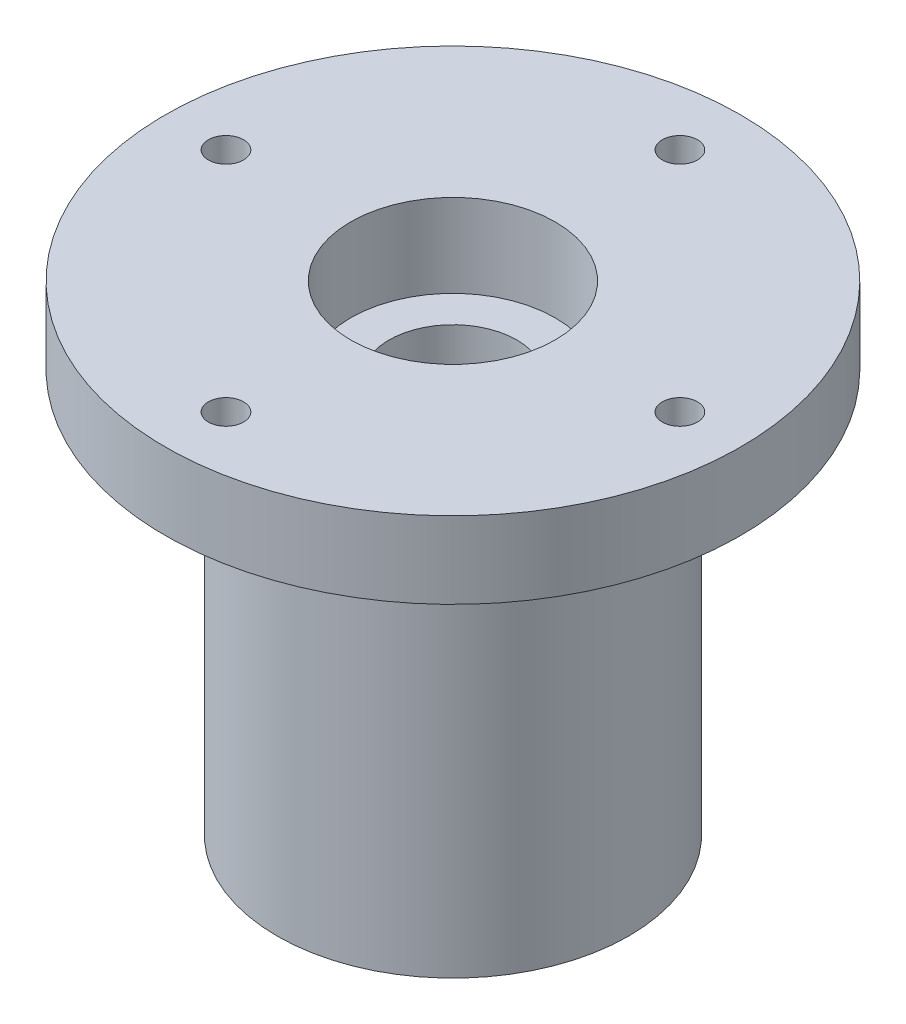
ISO-10303-21;
HEADER;
FILE_DESCRIPTION(('STEP AP214'),'2;1');
FILE_NAME('part.step','',(''),(''),'','','');
FILE_SCHEMA(('AUTOMOTIVE_DESIGN { 1 0 10303 214 1 1 1 1 }'));
ENDSEC;
DATA;
#1=APPLICATION_CONTEXT('core data for automotive mechanical design processes');
#2=APPLICATION_PROTOCOL_DEFINITION('international standard','automotive_design',2000,#1);
#3=PRODUCT_CONTEXT('',#1,'mechanical');
#4=PRODUCT('Part','Part','',(#3));
#5=PRODUCT_RELATED_PRODUCT_CATEGORY('part','',(#4));
#6=PRODUCT_DEFINITION_FORMATION('','',#4);
#7=PRODUCT_DEFINITION_CONTEXT('part definition',#1,'design');
#8=PRODUCT_DEFINITION('design','',#6,#7);
#9=PRODUCT_DEFINITION_SHAPE('','',#8);
#10=(LENGTH_UNIT() NAMED_UNIT(*) SI_UNIT(.MILLI.,.METRE.));
#11=(NAMED_UNIT(*) PLANE_ANGLE_UNIT() SI_UNIT($,.RADIAN.));
#12=(NAMED_UNIT(*) SI_UNIT($,.STERADIAN.) SOLID_ANGLE_UNIT());
#13=UNCERTAINTY_MEASURE_WITH_UNIT(LENGTH_MEASURE(1.E-05),#10,'distance_accuracy_value','');
#14=(GEOMETRIC_REPRESENTATION_CONTEXT(3) GLOBAL_UNCERTAINTY_ASSIGNED_CONTEXT((#13)) GLOBAL_UNIT_ASSIGNED_CONTEXT((#10,
#11,#12)) REPRESENTATION_CONTEXT('',''));
#15=CARTESIAN_POINT('',(0.,0.,0.));
#16=DIRECTION('',(0.,0.,1.));
#17=DIRECTION('',(1.,0.,0.));
#18=AXIS2_PLACEMENT_3D('',#15,#16,#17);
#19=CARTESIAN_POINT('',(-27.5,-12.,0.));
#20=DIRECTION('',(0.,1.,0.));
#21=DIRECTION('',(0.,0.,1.));
#22=AXIS2_PLACEMENT_3D('',#19,#20,#21);
#23=PLANE('',#22);
#24=CARTESIAN_POINT('',(0.,-12.,35.5));
#25=DIRECTION('',(0.,-1.,0.));
#26=DIRECTION('',(0.,0.,-1.));
#27=AXIS2_PLACEMENT_3D('',#24,#25,#26);
#28=CIRCLE('',#27,6.);
#29=CARTESIAN_POINT('',(0.,-12.,29.5));
#30=VERTEX_POINT('',#29);
#31=EDGE_CURVE('E102',#30,#30,#28,.T.);
#32=ORIENTED_EDGE('',*,*,#31,.F.);
#33=EDGE_LOOP('',(#32));
#34=FACE_BOUND('',#33,.T.);
#35=CARTESIAN_POINT('',(-35.5,-12.,0.));
#36=DIRECTION('',(0.,-1.,0.));
#37=DIRECTION('',(0.,0.,-1.));
#38=AXIS2_PLACEMENT_3D('',#35,#36,#37);
#39=CIRCLE('',#38,6.);
#40=CARTESIAN_POINT('',(-35.5,-12.,-6.));
#41=VERTEX_POINT('',#40);
#42=EDGE_CURVE('E93',#41,#41,#39,.T.);
#43=ORIENTED_EDGE('',*,*,#42,.F.);
#44=EDGE_LOOP('',(#43));
#45=FACE_BOUND('',#44,.T.);
#46=CARTESIAN_POINT('',(0.,-12.,-35.5));
#47=DIRECTION('',(0.,-1.,0.));
#48=DIRECTION('',(0.,0.,-1.));
#49=AXIS2_PLACEMENT_3D('',#46,#47,#48);
#50=CIRCLE('',#49,6.);
#51=CARTESIAN_POINT('',(0.,-12.,-41.5));
#52=VERTEX_POINT('',#51);
#53=EDGE_CURVE('E84',#52,#52,#50,.T.);
#54=ORIENTED_EDGE('',*,*,#53,.F.);
#55=EDGE_LOOP('',(#54));
#56=FACE_BOUND('',#55,.T.);
#57=CARTESIAN_POINT('',(0.,-12.,0.));
#58=DIRECTION('',(0.,-1.,0.));
#59=DIRECTION('',(0.,0.,-1.));
#60=AXIS2_PLACEMENT_3D('',#57,#58,#59);
#61=CIRCLE('',#60,27.5);
#62=CARTESIAN_POINT('',(0.,-12.,-27.5));
#63=VERTEX_POINT('',#62);
#64=EDGE_CURVE('E63',#63,#63,#61,.T.);
#65=ORIENTED_EDGE('',*,*,#64,.F.);
#66=EDGE_LOOP('',(#65));
#67=FACE_BOUND('',#66,.T.);
#68=CARTESIAN_POINT('',(0.,-12.,0.));
#69=DIRECTION('',(0.,-1.,0.));
#70=DIRECTION('',(0.,0.,-1.));
#71=AXIS2_PLACEMENT_3D('',#68,#69,#70);
#72=CIRCLE('',#71,45.);
#73=CARTESIAN_POINT('',(0.,-12.,-45.));
#74=VERTEX_POINT('',#73);
#75=EDGE_CURVE('E66',#74,#74,#72,.T.);
#76=ORIENTED_EDGE('',*,*,#75,.T.);
#77=EDGE_LOOP('',(#76));
#78=FACE_BOUND('',#77,.T.);
#79=CARTESIAN_POINT('',(35.5,-12.,0.));
#80=DIRECTION('',(0.,-1.,0.));
#81=DIRECTION('',(0.,0.,-1.));
#82=AXIS2_PLACEMENT_3D('',#79,#80,#81);
#83=CIRCLE('',#82,6.);
#84=CARTESIAN_POINT('',(35.5,-12.,-6.));
#85=VERTEX_POINT('',#84);
#86=EDGE_CURVE('E75',#85,#85,#83,.T.);
#87=ORIENTED_EDGE('',*,*,#86,.F.);
#88=EDGE_LOOP('',(#87));
#89=FACE_BOUND('',#88,.T.);
#90=ADVANCED_FACE('F31',(#34,#45,#56,#67,#78,#89),#23,.F.);
#91=CARTESIAN_POINT('',(0.,0.,0.));
#92=DIRECTION('',(0.,-1.,0.));
#93=DIRECTION('',(0.,0.,-1.));
#94=AXIS2_PLACEMENT_3D('',#91,#92,#93);
#95=CYLINDRICAL_SURFACE('',#94,45.);
#96=ORIENTED_EDGE('',*,*,#75,.F.);
#97=EDGE_LOOP('',(#96));
#98=FACE_BOUND('',#97,.T.);
#99=CARTESIAN_POINT('',(0.,0.,0.));
#100=DIRECTION('',(0.,-1.,0.));
#101=DIRECTION('',(0.,0.,-1.));
#102=AXIS2_PLACEMENT_3D('',#99,#100,#101);
#103=CIRCLE('',#102,45.);
#104=CARTESIAN_POINT('',(0.,0.,-45.));
#105=VERTEX_POINT('',#104);
#106=EDGE_CURVE('E10',#105,#105,#103,.T.);
#107=ORIENTED_EDGE('',*,*,#106,.T.);
#108=EDGE_LOOP('',(#107));
#109=FACE_BOUND('',#108,.T.);
#110=ADVANCED_FACE('F33',(#98,#109),#95,.T.);
#111=CARTESIAN_POINT('',(-45.,0.,0.));
#112=DIRECTION('',(0.,-1.,0.));
#113=DIRECTION('',(0.,0.,-1.));
#114=AXIS2_PLACEMENT_3D('',#111,#112,#113);
#115=PLANE('',#114);
#116=CARTESIAN_POINT('',(0.,0.,35.5));
#117=DIRECTION('',(0.,-1.,0.));
#118=DIRECTION('',(0.,0.,-1.));
#119=AXIS2_PLACEMENT_3D('',#116,#117,#118);
#120=CIRCLE('',#119,2.74999999999999);
#121=CARTESIAN_POINT('',(0.,0.,32.75));
#122=VERTEX_POINT('',#121);
#123=EDGE_CURVE('E96',#122,#122,#120,.T.);
#124=ORIENTED_EDGE('',*,*,#123,.T.);
#125=EDGE_LOOP('',(#124));
#126=FACE_BOUND('',#125,.T.);
#127=CARTESIAN_POINT('',(-35.5,0.,0.));
#128=DIRECTION('',(0.,-1.,0.));
#129=DIRECTION('',(0.,0.,-1.));
#130=AXIS2_PLACEMENT_3D('',#127,#128,#129);
#131=CIRCLE('',#130,2.74999999999999);
#132=CARTESIAN_POINT('',(-35.5,0.,-2.74999999999999));
#133=VERTEX_POINT('',#132);
#134=EDGE_CURVE('E87',#133,#133,#131,.T.);
#135=ORIENTED_EDGE('',*,*,#134,.T.);
#136=EDGE_LOOP('',(#135));
#137=FACE_BOUND('',#136,.T.);
#138=CARTESIAN_POINT('',(0.,0.,-35.5));
#139=DIRECTION('',(0.,-1.,0.));
#140=DIRECTION('',(0.,0.,-1.));
#141=AXIS2_PLACEMENT_3D('',#138,#139,#140);
#142=CIRCLE('',#141,2.74999999999999);
#143=CARTESIAN_POINT('',(0.,0.,-38.25));
#144=VERTEX_POINT('',#143);
#145=EDGE_CURVE('E78',#144,#144,#142,.T.);
#146=ORIENTED_EDGE('',*,*,#145,.T.);
#147=EDGE_LOOP('',(#146));
#148=FACE_BOUND('',#147,.T.);
#149=CARTESIAN_POINT('',(35.5,0.,0.));
#150=DIRECTION('',(0.,-1.,0.));
#151=DIRECTION('',(0.,0.,-1.));
#152=AXIS2_PLACEMENT_3D('',#149,#150,#151);
#153=CIRCLE('',#152,2.74999999999999);
#154=CARTESIAN_POINT('',(35.5,0.,-2.74999999999999));
#155=VERTEX_POINT('',#154);
#156=EDGE_CURVE('E69',#155,#155,#153,.T.);
#157=ORIENTED_EDGE('',*,*,#156,.T.);
#158=EDGE_LOOP('',(#157));
#159=FACE_BOUND('',#158,.T.);
#160=ORIENTED_EDGE('',*,*,#106,.F.);
#161=EDGE_LOOP('',(#160));
#162=FACE_BOUND('',#161,.T.);
#163=CARTESIAN_POINT('',(0.,0.,0.));
#164=DIRECTION('',(0.,-1.,0.));
#165=DIRECTION('',(0.,0.,-1.));
#166=AXIS2_PLACEMENT_3D('',#163,#164,#165);
#167=CIRCLE('',#166,16.);
#168=CARTESIAN_POINT('',(0.,0.,-16.));
#169=VERTEX_POINT('',#168);
#170=EDGE_CURVE('E38',#169,#169,#167,.T.);
#171=ORIENTED_EDGE('',*,*,#170,.T.);
#172=EDGE_LOOP('',(#171));
#173=FACE_BOUND('',#172,.T.);
#174=ADVANCED_FACE('F165',(#126,#137,#148,#159,#162,#173),#115,.F.);
#175=CARTESIAN_POINT('',(0.,0.,0.));
#176=DIRECTION('',(0.,-1.,0.));
#177=DIRECTION('',(0.,0.,-1.));
#178=AXIS2_PLACEMENT_3D('',#175,#176,#177);
#179=CYLINDRICAL_SURFACE('',#178,16.);
#180=ORIENTED_EDGE('',*,*,#170,.F.);
#181=EDGE_LOOP('',(#180));
#182=FACE_BOUND('',#181,.T.);
#183=CARTESIAN_POINT('',(0.,-13.,0.));
#184=DIRECTION('',(0.,-1.,0.));
#185=DIRECTION('',(0.,0.,-1.));
#186=AXIS2_PLACEMENT_3D('',#183,#184,#185);
#187=CIRCLE('',#186,16.);
#188=CARTESIAN_POINT('',(0.,-13.,-16.));
#189=VERTEX_POINT('',#188);
#190=EDGE_CURVE('E42',#189,#189,#187,.T.);
#191=ORIENTED_EDGE('',*,*,#190,.T.);
#192=EDGE_LOOP('',(#191));
#193=FACE_BOUND('',#192,.T.);
#194=ADVANCED_FACE('F162',(#182,#193),#179,.F.);
#195=CARTESIAN_POINT('',(-16.,-13.,0.));
#196=DIRECTION('',(0.,-1.,0.));
#197=DIRECTION('',(0.,0.,-1.));
#198=AXIS2_PLACEMENT_3D('',#195,#196,#197);
#199=PLANE('',#198);
#200=ORIENTED_EDGE('',*,*,#190,.F.);
#201=EDGE_LOOP('',(#200));
#202=FACE_BOUND('',#201,.T.);
#203=CARTESIAN_POINT('',(0.,-13.,0.));
#204=DIRECTION('',(0.,-1.,0.));
#205=DIRECTION('',(0.,0.,-1.));
#206=AXIS2_PLACEMENT_3D('',#203,#204,#205);
#207=CIRCLE('',#206,10.);
#208=CARTESIAN_POINT('',(0.,-13.,-10.));
#209=VERTEX_POINT('',#208);
#210=EDGE_CURVE('E46',#209,#209,#207,.T.);
#211=ORIENTED_EDGE('',*,*,#210,.T.);
#212=EDGE_LOOP('',(#211));
#213=FACE_BOUND('',#212,.T.);
#214=ADVANCED_FACE('F158',(#202,#213),#199,.F.);
#215=CARTESIAN_POINT('',(0.,0.,0.));
#216=DIRECTION('',(0.,-1.,0.));
#217=DIRECTION('',(0.,0.,-1.));
#218=AXIS2_PLACEMENT_3D('',#215,#216,#217);
#219=CYLINDRICAL_SURFACE('',#218,10.);
#220=ORIENTED_EDGE('',*,*,#210,.F.);
#221=EDGE_LOOP('',(#220));
#222=FACE_BOUND('',#221,.T.);
#223=CARTESIAN_POINT('',(0.,-62.,0.));
#224=DIRECTION('',(0.,-1.,0.));
#225=DIRECTION('',(0.,0.,-1.));
#226=AXIS2_PLACEMENT_3D('',#223,#224,#225);
#227=CIRCLE('',#226,9.99999999999999);
#228=CARTESIAN_POINT('',(0.,-62.,-9.99999999999999));
#229=VERTEX_POINT('',#228);
#230=EDGE_CURVE('E51',#229,#229,#227,.T.);
#231=ORIENTED_EDGE('',*,*,#230,.T.);
#232=EDGE_LOOP('',(#231));
#233=FACE_BOUND('',#232,.T.);
#234=ADVANCED_FACE('F154',(#222,#233),#219,.F.);
#235=CARTESIAN_POINT('',(-9.99999999999999,-62.,0.));
#236=DIRECTION('',(0.,1.,0.));
#237=DIRECTION('',(0.,0.,1.));
#238=AXIS2_PLACEMENT_3D('',#235,#236,#237);
#239=PLANE('',#238);
#240=ORIENTED_EDGE('',*,*,#230,.F.);
#241=EDGE_LOOP('',(#240));
#242=FACE_BOUND('',#241,.T.);
#243=CARTESIAN_POINT('',(0.,-62.,0.));
#244=DIRECTION('',(0.,-1.,0.));
#245=DIRECTION('',(0.,0.,-1.));
#246=AXIS2_PLACEMENT_3D('',#243,#244,#245);
#247=CIRCLE('',#246,16.);
#248=CARTESIAN_POINT('',(0.,-62.,-16.));
#249=VERTEX_POINT('',#248);
#250=EDGE_CURVE('E54',#249,#249,#247,.T.);
#251=ORIENTED_EDGE('',*,*,#250,.T.);
#252=EDGE_LOOP('',(#251));
#253=FACE_BOUND('',#252,.T.);
#254=ADVANCED_FACE('F150',(#242,#253),#239,.F.);
#255=CARTESIAN_POINT('',(0.,0.,0.));
#256=DIRECTION('',(0.,-1.,0.));
#257=DIRECTION('',(0.,0.,-1.));
#258=AXIS2_PLACEMENT_3D('',#255,#256,#257);
#259=CYLINDRICAL_SURFACE('',#258,16.);
#260=ORIENTED_EDGE('',*,*,#250,.F.);
#261=EDGE_LOOP('',(#260));
#262=FACE_BOUND('',#261,.T.);
#263=CARTESIAN_POINT('',(0.,-75.,0.));
#264=DIRECTION('',(0.,-1.,0.));
#265=DIRECTION('',(0.,0.,-1.));
#266=AXIS2_PLACEMENT_3D('',#263,#264,#265);
#267=CIRCLE('',#266,16.);
#268=CARTESIAN_POINT('',(0.,-75.,-16.));
#269=VERTEX_POINT('',#268);
#270=EDGE_CURVE('E57',#269,#269,#267,.T.);
#271=ORIENTED_EDGE('',*,*,#270,.T.);
#272=EDGE_LOOP('',(#271));
#273=FACE_BOUND('',#272,.T.);
#274=ADVANCED_FACE('F146',(#262,#273),#259,.F.);
#275=CARTESIAN_POINT('',(-16.,-75.,0.));
#276=DIRECTION('',(0.,1.,0.));
#277=DIRECTION('',(0.,0.,1.));
#278=AXIS2_PLACEMENT_3D('',#275,#276,#277);
#279=PLANE('',#278);
#280=ORIENTED_EDGE('',*,*,#270,.F.);
#281=EDGE_LOOP('',(#280));
#282=FACE_BOUND('',#281,.T.);
#283=CARTESIAN_POINT('',(0.,-75.,0.));
#284=DIRECTION('',(0.,-1.,0.));
#285=DIRECTION('',(0.,0.,-1.));
#286=AXIS2_PLACEMENT_3D('',#283,#284,#285);
#287=CIRCLE('',#286,27.5);
#288=CARTESIAN_POINT('',(0.,-75.,-27.5));
#289=VERTEX_POINT('',#288);
#290=EDGE_CURVE('E60',#289,#289,#287,.T.);
#291=ORIENTED_EDGE('',*,*,#290,.T.);
#292=EDGE_LOOP('',(#291));
#293=FACE_BOUND('',#292,.T.);
#294=ADVANCED_FACE('F142',(#282,#293),#279,.F.);
#295=CARTESIAN_POINT('',(0.,0.,0.));
#296=DIRECTION('',(0.,-1.,0.));
#297=DIRECTION('',(0.,0.,-1.));
#298=AXIS2_PLACEMENT_3D('',#295,#296,#297);
#299=CYLINDRICAL_SURFACE('',#298,27.5);
#300=ORIENTED_EDGE('',*,*,#290,.F.);
#301=EDGE_LOOP('',(#300));
#302=FACE_BOUND('',#301,.T.);
#303=ORIENTED_EDGE('',*,*,#64,.T.);
#304=EDGE_LOOP('',(#303));
#305=FACE_BOUND('',#304,.T.);
#306=ADVANCED_FACE('F134',(#302,#305),#299,.T.);
#307=CARTESIAN_POINT('',(35.5,-12.,0.));
#308=DIRECTION('',(0.,-1.,0.));
#309=DIRECTION('',(0.,0.,-1.));
#310=AXIS2_PLACEMENT_3D('',#307,#308,#309);
#311=CYLINDRICAL_SURFACE('',#310,2.74999999999999);
#312=ORIENTED_EDGE('',*,*,#156,.F.);
#313=EDGE_LOOP('',(#312));
#314=FACE_BOUND('',#313,.T.);
#315=CARTESIAN_POINT('',(35.5,-8.75,0.));
#316=DIRECTION('',(0.,-1.,0.));
#317=DIRECTION('',(0.,0.,-1.));
#318=AXIS2_PLACEMENT_3D('',#315,#316,#317);
#319=CIRCLE('',#318,2.74999999999999);
#320=CARTESIAN_POINT('',(35.5,-8.75,-2.74999999999999));
#321=VERTEX_POINT('',#320);
#322=EDGE_CURVE('E72',#321,#321,#319,.T.);
#323=ORIENTED_EDGE('',*,*,#322,.T.);
#324=EDGE_LOOP('',(#323));
#325=FACE_BOUND('',#324,.T.);
#326=ADVANCED_FACE('F124',(#314,#325),#311,.F.);
#327=CARTESIAN_POINT('',(35.5,-12.,0.));
#328=DIRECTION('',(0.,-1.,0.));
#329=DIRECTION('',(0.,0.,-1.));
#330=AXIS2_PLACEMENT_3D('',#327,#328,#329);
#331=CONICAL_SURFACE('',#330,6.,0.785398163397449);
#332=ORIENTED_EDGE('',*,*,#322,.F.);
#333=EDGE_LOOP('',(#332));
#334=FACE_BOUND('',#333,.T.);
#335=ORIENTED_EDGE('',*,*,#86,.T.);
#336=EDGE_LOOP('',(#335));
#337=FACE_BOUND('',#336,.T.);
#338=ADVANCED_FACE('F121',(#334,#337),#331,.F.);
#339=CARTESIAN_POINT('',(0.,-12.,-35.5));
#340=DIRECTION('',(0.,-1.,0.));
#341=DIRECTION('',(0.,0.,-1.));
#342=AXIS2_PLACEMENT_3D('',#339,#340,#341);
#343=CYLINDRICAL_SURFACE('',#342,2.74999999999999);
#344=ORIENTED_EDGE('',*,*,#145,.F.);
#345=EDGE_LOOP('',(#344));
#346=FACE_BOUND('',#345,.T.);
#347=CARTESIAN_POINT('',(0.,-8.75,-35.5));
#348=DIRECTION('',(0.,-1.,0.));
#349=DIRECTION('',(0.,0.,-1.));
#350=AXIS2_PLACEMENT_3D('',#347,#348,#349);
#351=CIRCLE('',#350,2.74999999999999);
#352=CARTESIAN_POINT('',(0.,-8.75,-38.25));
#353=VERTEX_POINT('',#352);
#354=EDGE_CURVE('E81',#353,#353,#351,.T.);
#355=ORIENTED_EDGE('',*,*,#354,.T.);
#356=EDGE_LOOP('',(#355));
#357=FACE_BOUND('',#356,.T.);
#358=ADVANCED_FACE('F123',(#346,#357),#343,.F.);
#359=CARTESIAN_POINT('',(0.,-12.,-35.5));
#360=DIRECTION('',(0.,-1.,0.));
#361=DIRECTION('',(0.,0.,-1.));
#362=AXIS2_PLACEMENT_3D('',#359,#360,#361);
#363=CONICAL_SURFACE('',#362,6.,0.785398163397449);
#364=ORIENTED_EDGE('',*,*,#354,.F.);
#365=EDGE_LOOP('',(#364));
#366=FACE_BOUND('',#365,.T.);
#367=ORIENTED_EDGE('',*,*,#53,.T.);
#368=EDGE_LOOP('',(#367));
#369=FACE_BOUND('',#368,.T.);
#370=ADVANCED_FACE('F131',(#366,#369),#363,.F.);
#371=CARTESIAN_POINT('',(-35.5,-12.,0.));
#372=DIRECTION('',(0.,-1.,0.));
#373=DIRECTION('',(0.,0.,-1.));
#374=AXIS2_PLACEMENT_3D('',#371,#372,#373);
#375=CYLINDRICAL_SURFACE('',#374,2.74999999999999);
#376=ORIENTED_EDGE('',*,*,#134,.F.);
#377=EDGE_LOOP('',(#376));
#378=FACE_BOUND('',#377,.T.);
#379=CARTESIAN_POINT('',(-35.5,-8.75,0.));
#380=DIRECTION('',(0.,-1.,0.));
#381=DIRECTION('',(0.,0.,-1.));
#382=AXIS2_PLACEMENT_3D('',#379,#380,#381);
#383=CIRCLE('',#382,2.74999999999999);
#384=CARTESIAN_POINT('',(-35.5,-8.75,-2.74999999999999));
#385=VERTEX_POINT('',#384);
#386=EDGE_CURVE('E90',#385,#385,#383,.T.);
#387=ORIENTED_EDGE('',*,*,#386,.T.);
#388=EDGE_LOOP('',(#387));
#389=FACE_BOUND('',#388,.T.);
#390=ADVANCED_FACE('F187',(#378,#389),#375,.F.);
#391=CARTESIAN_POINT('',(-35.5,-12.,0.));
#392=DIRECTION('',(0.,-1.,0.));
#393=DIRECTION('',(0.,0.,-1.));
#394=AXIS2_PLACEMENT_3D('',#391,#392,#393);
#395=CONICAL_SURFACE('',#394,6.,0.785398163397449);
#396=ORIENTED_EDGE('',*,*,#386,.F.);
#397=EDGE_LOOP('',(#396));
#398=FACE_BOUND('',#397,.T.);
#399=ORIENTED_EDGE('',*,*,#42,.T.);
#400=EDGE_LOOP('',(#399));
#401=FACE_BOUND('',#400,.T.);
#402=ADVANCED_FACE('F191',(#398,#401),#395,.F.);
#403=CARTESIAN_POINT('',(0.,-12.,35.5));
#404=DIRECTION('',(0.,-1.,0.));
#405=DIRECTION('',(0.,0.,-1.));
#406=AXIS2_PLACEMENT_3D('',#403,#404,#405);
#407=CYLINDRICAL_SURFACE('',#406,2.74999999999999);
#408=ORIENTED_EDGE('',*,*,#123,.F.);
#409=EDGE_LOOP('',(#408));
#410=FACE_BOUND('',#409,.T.);
#411=CARTESIAN_POINT('',(0.,-8.75,35.5));
#412=DIRECTION('',(0.,-1.,0.));
#413=DIRECTION('',(0.,0.,-1.));
#414=AXIS2_PLACEMENT_3D('',#411,#412,#413);
#415=CIRCLE('',#414,2.74999999999999);
#416=CARTESIAN_POINT('',(0.,-8.75,32.75));
#417=VERTEX_POINT('',#416);
#418=EDGE_CURVE('E99',#417,#417,#415,.T.);
#419=ORIENTED_EDGE('',*,*,#418,.T.);
#420=EDGE_LOOP('',(#419));
#421=FACE_BOUND('',#420,.T.);
#422=ADVANCED_FACE('F197',(#410,#421),#407,.F.);
#423=CARTESIAN_POINT('',(0.,-12.,35.5));
#424=DIRECTION('',(0.,-1.,0.));
#425=DIRECTION('',(0.,0.,-1.));
#426=AXIS2_PLACEMENT_3D('',#423,#424,#425);
#427=CONICAL_SURFACE('',#426,6.,0.785398163397449);
#428=ORIENTED_EDGE('',*,*,#418,.F.);
#429=EDGE_LOOP('',(#428));
#430=FACE_BOUND('',#429,.T.);
#431=ORIENTED_EDGE('',*,*,#31,.T.);
#432=EDGE_LOOP('',(#431));
#433=FACE_BOUND('',#432,.T.);
#434=ADVANCED_FACE('F106',(#430,#433),#427,.F.);
#435=CLOSED_SHELL('',(#90,#110,#174,#194,#214,#234,#254,#274,#294,#306,#326,#338,#358,#370,#390,
#402,#422,#434));
#436=MANIFOLD_SOLID_BREP('B2',#435);
#437=ADVANCED_BREP_SHAPE_REPRESENTATION('',(#18,#436),#14);
#438=SHAPE_DEFINITION_REPRESENTATION(#9,#437);
ENDSEC;
END-ISO-10303-21;
